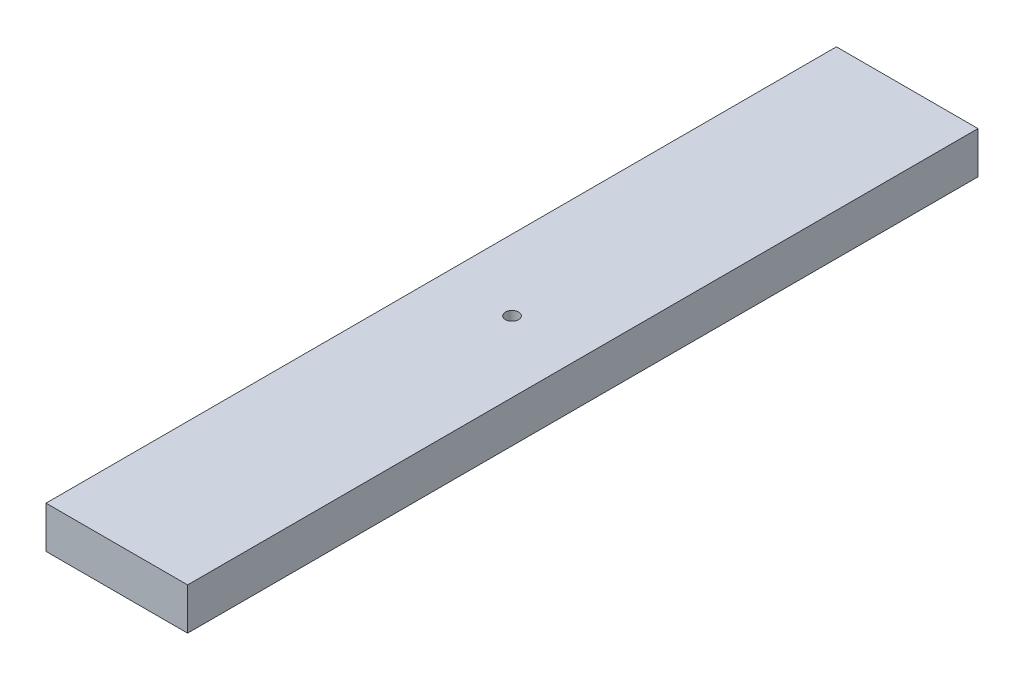
ISO-10303-21;
HEADER;
FILE_DESCRIPTION(('STEP AP214'),'2;1');
FILE_NAME('part.step','',(''),(''),'','','');
FILE_SCHEMA(('AUTOMOTIVE_DESIGN { 1 0 10303 214 1 1 1 1 }'));
ENDSEC;
DATA;
#1=APPLICATION_CONTEXT('core data for automotive mechanical design processes');
#2=APPLICATION_PROTOCOL_DEFINITION('international standard','automotive_design',2000,#1);
#3=PRODUCT_CONTEXT('',#1,'mechanical');
#4=PRODUCT('Part','Part','',(#3));
#5=PRODUCT_RELATED_PRODUCT_CATEGORY('part','',(#4));
#6=PRODUCT_DEFINITION_FORMATION('','',#4);
#7=PRODUCT_DEFINITION_CONTEXT('part definition',#1,'design');
#8=PRODUCT_DEFINITION('design','',#6,#7);
#9=PRODUCT_DEFINITION_SHAPE('','',#8);
#10=(LENGTH_UNIT() NAMED_UNIT(*) SI_UNIT(.MILLI.,.METRE.));
#11=(NAMED_UNIT(*) PLANE_ANGLE_UNIT() SI_UNIT($,.RADIAN.));
#12=(NAMED_UNIT(*) SI_UNIT($,.STERADIAN.) SOLID_ANGLE_UNIT());
#13=UNCERTAINTY_MEASURE_WITH_UNIT(LENGTH_MEASURE(1.E-05),#10,'distance_accuracy_value','');
#14=(GEOMETRIC_REPRESENTATION_CONTEXT(3) GLOBAL_UNCERTAINTY_ASSIGNED_CONTEXT((#13)) GLOBAL_UNIT_ASSIGNED_CONTEXT((#10,
#11,#12)) REPRESENTATION_CONTEXT('',''));
#15=CARTESIAN_POINT('',(0.,0.,0.));
#16=DIRECTION('',(0.,0.,1.));
#17=DIRECTION('',(1.,0.,0.));
#18=AXIS2_PLACEMENT_3D('',#15,#16,#17);
#19=CARTESIAN_POINT('',(0.,6.35,0.));
#20=DIRECTION('',(0.,-1.,0.));
#21=DIRECTION('',(0.,0.,-1.));
#22=AXIS2_PLACEMENT_3D('',#19,#20,#21);
#23=PLANE('',#22);
#24=DIRECTION('',(0.,0.,-1.));
#25=VECTOR('',#24,1.);
#26=CARTESIAN_POINT('',(10.75,6.35,60.));
#27=LINE('',#26,#25);
#28=CARTESIAN_POINT('',(10.75,6.35,60.));
#29=VERTEX_POINT('',#28);
#30=CARTESIAN_POINT('',(10.75,6.35,-60.));
#31=VERTEX_POINT('',#30);
#32=EDGE_CURVE('E95',#29,#31,#27,.T.);
#33=ORIENTED_EDGE('',*,*,#32,.T.);
#34=DIRECTION('',(-1.,0.,0.));
#35=VECTOR('',#34,1.);
#36=CARTESIAN_POINT('',(-10.75,6.35,-60.));
#37=LINE('',#36,#35);
#38=CARTESIAN_POINT('',(-10.75,6.35,-60.));
#39=VERTEX_POINT('',#38);
#40=EDGE_CURVE('E90',#31,#39,#37,.T.);
#41=ORIENTED_EDGE('',*,*,#40,.T.);
#42=DIRECTION('',(0.,0.,1.));
#43=VECTOR('',#42,1.);
#44=CARTESIAN_POINT('',(-10.75,6.35,60.));
#45=LINE('',#44,#43);
#46=CARTESIAN_POINT('',(-10.75,6.35,60.));
#47=VERTEX_POINT('',#46);
#48=EDGE_CURVE('E93',#39,#47,#45,.T.);
#49=ORIENTED_EDGE('',*,*,#48,.T.);
#50=DIRECTION('',(1.,0.,0.));
#51=VECTOR('',#50,1.);
#52=CARTESIAN_POINT('',(-10.75,6.35,60.));
#53=LINE('',#52,#51);
#54=EDGE_CURVE('E60',#47,#29,#53,.T.);
#55=ORIENTED_EDGE('',*,*,#54,.T.);
#56=EDGE_LOOP('',(#33,#41,#49,#55));
#57=FACE_BOUND('',#56,.T.);
#58=CARTESIAN_POINT('',(0.,6.35,0.));
#59=DIRECTION('',(0.,1.,0.));
#60=DIRECTION('',(0.,0.,1.));
#61=AXIS2_PLACEMENT_3D('',#58,#59,#60);
#62=CIRCLE('',#61,1.);
#63=CARTESIAN_POINT('',(0.,6.35,1.00000000000001));
#64=VERTEX_POINT('',#63);
#65=EDGE_CURVE('E110',#64,#64,#62,.T.);
#66=ORIENTED_EDGE('',*,*,#65,.F.);
#67=EDGE_LOOP('',(#66));
#68=FACE_BOUND('',#67,.T.);
#69=ADVANCED_FACE('F43',(#57,#68),#23,.F.);
#70=CARTESIAN_POINT('',(0.,0.,0.));
#71=DIRECTION('',(0.,-1.,0.));
#72=DIRECTION('',(0.,0.,-1.));
#73=AXIS2_PLACEMENT_3D('',#70,#71,#72);
#74=PLANE('',#73);
#75=DIRECTION('',(0.,0.,-1.));
#76=VECTOR('',#75,1.);
#77=CARTESIAN_POINT('',(10.75,0.,60.));
#78=LINE('',#77,#76);
#79=CARTESIAN_POINT('',(10.75,0.,60.));
#80=VERTEX_POINT('',#79);
#81=CARTESIAN_POINT('',(10.75,0.,-60.));
#82=VERTEX_POINT('',#81);
#83=EDGE_CURVE('E107',#80,#82,#78,.T.);
#84=ORIENTED_EDGE('',*,*,#83,.F.);
#85=DIRECTION('',(1.,0.,0.));
#86=VECTOR('',#85,1.);
#87=CARTESIAN_POINT('',(-10.75,0.,60.));
#88=LINE('',#87,#86);
#89=CARTESIAN_POINT('',(-10.75,0.,60.));
#90=VERTEX_POINT('',#89);
#91=EDGE_CURVE('E83',#90,#80,#88,.T.);
#92=ORIENTED_EDGE('',*,*,#91,.F.);
#93=DIRECTION('',(0.,0.,1.));
#94=VECTOR('',#93,1.);
#95=CARTESIAN_POINT('',(-10.75,0.,60.));
#96=LINE('',#95,#94);
#97=CARTESIAN_POINT('',(-10.75,0.,-60.));
#98=VERTEX_POINT('',#97);
#99=EDGE_CURVE('E77',#98,#90,#96,.T.);
#100=ORIENTED_EDGE('',*,*,#99,.F.);
#101=DIRECTION('',(-1.,0.,0.));
#102=VECTOR('',#101,1.);
#103=CARTESIAN_POINT('',(-10.75,0.,-60.));
#104=LINE('',#103,#102);
#105=EDGE_CURVE('E99',#82,#98,#104,.T.);
#106=ORIENTED_EDGE('',*,*,#105,.F.);
#107=EDGE_LOOP('',(#84,#92,#100,#106));
#108=FACE_BOUND('',#107,.T.);
#109=CARTESIAN_POINT('',(0.,0.,0.));
#110=DIRECTION('',(0.,1.,0.));
#111=DIRECTION('',(0.,0.,1.));
#112=AXIS2_PLACEMENT_3D('',#109,#110,#111);
#113=CIRCLE('',#112,1.);
#114=CARTESIAN_POINT('',(0.,0.,1.00000000000001));
#115=VERTEX_POINT('',#114);
#116=EDGE_CURVE('E122',#115,#115,#113,.T.);
#117=ORIENTED_EDGE('',*,*,#116,.T.);
#118=EDGE_LOOP('',(#117));
#119=FACE_BOUND('',#118,.T.);
#120=ADVANCED_FACE('F118',(#108,#119),#74,.T.);
#121=CARTESIAN_POINT('',(10.75,6.35,60.));
#122=DIRECTION('',(-1.,0.,0.));
#123=DIRECTION('',(0.,0.,1.));
#124=AXIS2_PLACEMENT_3D('',#121,#122,#123);
#125=PLANE('',#124);
#126=ORIENTED_EDGE('',*,*,#83,.T.);
#127=DIRECTION('',(0.,-1.,0.));
#128=VECTOR('',#127,1.);
#129=CARTESIAN_POINT('',(10.75,6.35,-60.));
#130=LINE('',#129,#128);
#131=EDGE_CURVE('E11',#31,#82,#130,.T.);
#132=ORIENTED_EDGE('',*,*,#131,.F.);
#133=ORIENTED_EDGE('',*,*,#32,.F.);
#134=DIRECTION('',(0.,-1.,0.));
#135=VECTOR('',#134,1.);
#136=CARTESIAN_POINT('',(10.75,6.35,60.));
#137=LINE('',#136,#135);
#138=EDGE_CURVE('E103',#29,#80,#137,.T.);
#139=ORIENTED_EDGE('',*,*,#138,.T.);
#140=EDGE_LOOP('',(#126,#132,#133,#139));
#141=FACE_BOUND('',#140,.T.);
#142=ADVANCED_FACE('F45',(#141),#125,.F.);
#143=CARTESIAN_POINT('',(-10.75,6.35,-60.));
#144=DIRECTION('',(0.,0.,1.));
#145=DIRECTION('',(1.,0.,0.));
#146=AXIS2_PLACEMENT_3D('',#143,#144,#145);
#147=PLANE('',#146);
#148=ORIENTED_EDGE('',*,*,#105,.T.);
#149=DIRECTION('',(0.,-1.,0.));
#150=VECTOR('',#149,1.);
#151=CARTESIAN_POINT('',(-10.75,6.35,-60.));
#152=LINE('',#151,#150);
#153=EDGE_CURVE('E52',#39,#98,#152,.T.);
#154=ORIENTED_EDGE('',*,*,#153,.F.);
#155=ORIENTED_EDGE('',*,*,#40,.F.);
#156=ORIENTED_EDGE('',*,*,#131,.T.);
#157=EDGE_LOOP('',(#148,#154,#155,#156));
#158=FACE_BOUND('',#157,.T.);
#159=ADVANCED_FACE('F98',(#158),#147,.F.);
#160=CARTESIAN_POINT('',(-10.75,6.35,60.));
#161=DIRECTION('',(1.,0.,0.));
#162=DIRECTION('',(0.,0.,-1.));
#163=AXIS2_PLACEMENT_3D('',#160,#161,#162);
#164=PLANE('',#163);
#165=ORIENTED_EDGE('',*,*,#99,.T.);
#166=DIRECTION('',(0.,-1.,0.));
#167=VECTOR('',#166,1.);
#168=CARTESIAN_POINT('',(-10.75,6.35,60.));
#169=LINE('',#168,#167);
#170=EDGE_CURVE('E100',#47,#90,#169,.T.);
#171=ORIENTED_EDGE('',*,*,#170,.F.);
#172=ORIENTED_EDGE('',*,*,#48,.F.);
#173=ORIENTED_EDGE('',*,*,#153,.T.);
#174=EDGE_LOOP('',(#165,#171,#172,#173));
#175=FACE_BOUND('',#174,.T.);
#176=ADVANCED_FACE('F101',(#175),#164,.F.);
#177=CARTESIAN_POINT('',(-10.75,6.35,60.));
#178=DIRECTION('',(0.,0.,-1.));
#179=DIRECTION('',(-1.,0.,0.));
#180=AXIS2_PLACEMENT_3D('',#177,#178,#179);
#181=PLANE('',#180);
#182=ORIENTED_EDGE('',*,*,#91,.T.);
#183=ORIENTED_EDGE('',*,*,#138,.F.);
#184=ORIENTED_EDGE('',*,*,#54,.F.);
#185=ORIENTED_EDGE('',*,*,#170,.T.);
#186=EDGE_LOOP('',(#182,#183,#184,#185));
#187=FACE_BOUND('',#186,.T.);
#188=ADVANCED_FACE('F115',(#187),#181,.F.);
#189=CARTESIAN_POINT('',(0.,6.35,0.));
#190=DIRECTION('',(0.,-1.,0.));
#191=DIRECTION('',(0.,0.,-1.));
#192=AXIS2_PLACEMENT_3D('',#189,#190,#191);
#193=CYLINDRICAL_SURFACE('',#192,1.);
#194=ORIENTED_EDGE('',*,*,#65,.T.);
#195=EDGE_LOOP('',(#194));
#196=FACE_BOUND('',#195,.T.);
#197=ORIENTED_EDGE('',*,*,#116,.F.);
#198=EDGE_LOOP('',(#197));
#199=FACE_BOUND('',#198,.T.);
#200=ADVANCED_FACE('F128',(#196,#199),#193,.F.);
#201=CLOSED_SHELL('',(#69,#120,#142,#159,#176,#188,#200));
#202=MANIFOLD_SOLID_BREP('B2',#201);
#203=ADVANCED_BREP_SHAPE_REPRESENTATION('',(#18,#202),#14);
#204=SHAPE_DEFINITION_REPRESENTATION(#9,#203);
ENDSEC;
END-ISO-10303-21;
